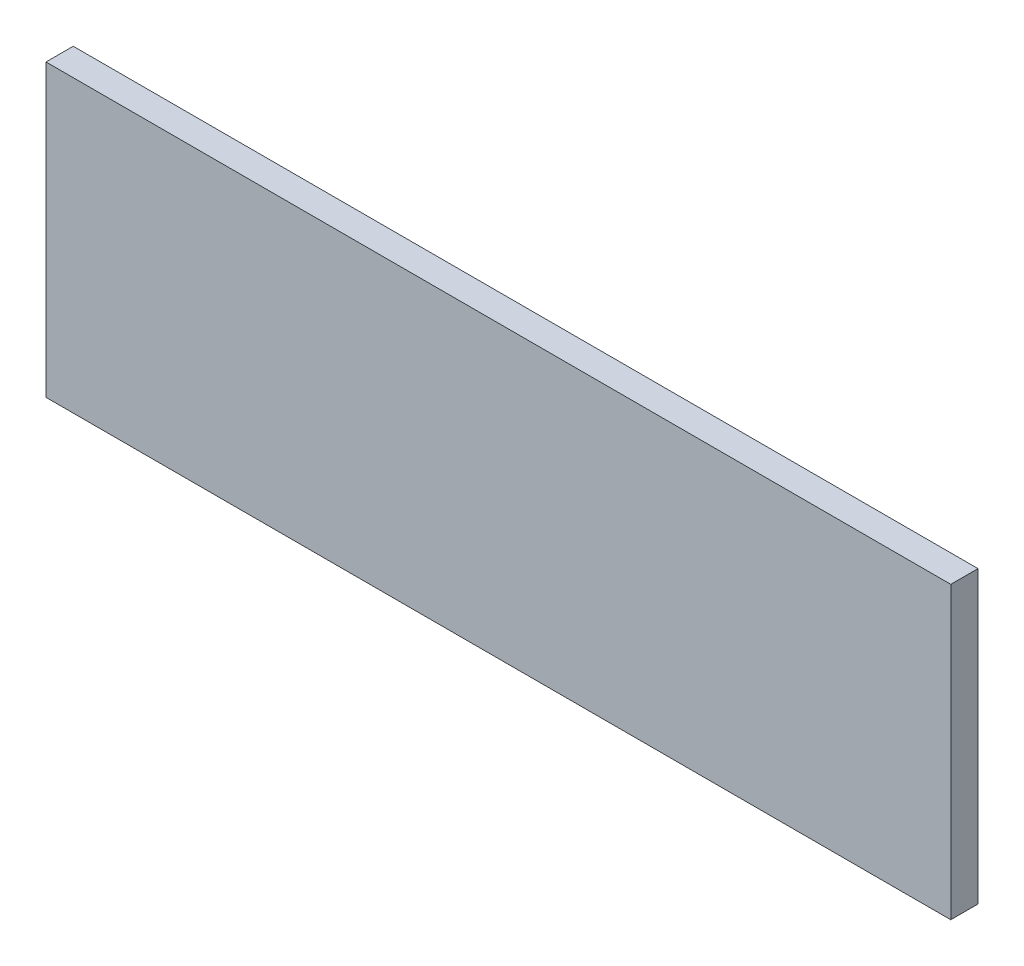
ISO-10303-21;
HEADER;
FILE_DESCRIPTION(('STEP AP214'),'2;1');
FILE_NAME('part.step','',(''),(''),'','','');
FILE_SCHEMA(('AUTOMOTIVE_DESIGN { 1 0 10303 214 1 1 1 1 }'));
ENDSEC;
DATA;
#1=APPLICATION_CONTEXT('core data for automotive mechanical design processes');
#2=APPLICATION_PROTOCOL_DEFINITION('international standard','automotive_design',2000,#1);
#3=PRODUCT_CONTEXT('',#1,'mechanical');
#4=PRODUCT('Part','Part','',(#3));
#5=PRODUCT_RELATED_PRODUCT_CATEGORY('part','',(#4));
#6=PRODUCT_DEFINITION_FORMATION('','',#4);
#7=PRODUCT_DEFINITION_CONTEXT('part definition',#1,'design');
#8=PRODUCT_DEFINITION('design','',#6,#7);
#9=PRODUCT_DEFINITION_SHAPE('','',#8);
#10=(LENGTH_UNIT() NAMED_UNIT(*) SI_UNIT(.MILLI.,.METRE.));
#11=(NAMED_UNIT(*) PLANE_ANGLE_UNIT() SI_UNIT($,.RADIAN.));
#12=(NAMED_UNIT(*) SI_UNIT($,.STERADIAN.) SOLID_ANGLE_UNIT());
#13=UNCERTAINTY_MEASURE_WITH_UNIT(LENGTH_MEASURE(1.E-05),#10,'distance_accuracy_value','');
#14=(GEOMETRIC_REPRESENTATION_CONTEXT(3) GLOBAL_UNCERTAINTY_ASSIGNED_CONTEXT((#13)) GLOBAL_UNIT_ASSIGNED_CONTEXT((#10,
#11,#12)) REPRESENTATION_CONTEXT('',''));
#15=CARTESIAN_POINT('',(0.,0.,0.));
#16=DIRECTION('',(0.,0.,1.));
#17=DIRECTION('',(1.,0.,0.));
#18=AXIS2_PLACEMENT_3D('',#15,#16,#17);
#19=CARTESIAN_POINT('',(-299.,-96.,18.));
#20=DIRECTION('',(1.,0.,0.));
#21=DIRECTION('',(0.,0.,-1.));
#22=AXIS2_PLACEMENT_3D('',#19,#20,#21);
#23=PLANE('',#22);
#24=DIRECTION('',(0.,-1.,0.));
#25=VECTOR('',#24,1.);
#26=CARTESIAN_POINT('',(-299.,-96.,0.));
#27=LINE('',#26,#25);
#28=CARTESIAN_POINT('',(-299.,96.,0.));
#29=VERTEX_POINT('',#28);
#30=CARTESIAN_POINT('',(-299.,-96.,0.));
#31=VERTEX_POINT('',#30);
#32=EDGE_CURVE('E96',#29,#31,#27,.T.);
#33=ORIENTED_EDGE('',*,*,#32,.T.);
#34=DIRECTION('',(0.,0.,-1.));
#35=VECTOR('',#34,1.);
#36=CARTESIAN_POINT('',(-299.,-96.,18.));
#37=LINE('',#36,#35);
#38=CARTESIAN_POINT('',(-299.,-96.,18.));
#39=VERTEX_POINT('',#38);
#40=EDGE_CURVE('E11',#39,#31,#37,.T.);
#41=ORIENTED_EDGE('',*,*,#40,.F.);
#42=DIRECTION('',(0.,-1.,0.));
#43=VECTOR('',#42,1.);
#44=CARTESIAN_POINT('',(-299.,-96.,18.));
#45=LINE('',#44,#43);
#46=CARTESIAN_POINT('',(-299.,96.,18.));
#47=VERTEX_POINT('',#46);
#48=EDGE_CURVE('E84',#47,#39,#45,.T.);
#49=ORIENTED_EDGE('',*,*,#48,.F.);
#50=DIRECTION('',(0.,0.,-1.));
#51=VECTOR('',#50,1.);
#52=CARTESIAN_POINT('',(-299.,96.,18.));
#53=LINE('',#52,#51);
#54=EDGE_CURVE('E92',#47,#29,#53,.T.);
#55=ORIENTED_EDGE('',*,*,#54,.T.);
#56=EDGE_LOOP('',(#33,#41,#49,#55));
#57=FACE_BOUND('',#56,.T.);
#58=ADVANCED_FACE('F33',(#57),#23,.F.);
#59=CARTESIAN_POINT('',(299.,-96.,18.));
#60=DIRECTION('',(0.,1.,0.));
#61=DIRECTION('',(-1.,0.,0.));
#62=AXIS2_PLACEMENT_3D('',#59,#60,#61);
#63=PLANE('',#62);
#64=DIRECTION('',(1.,0.,0.));
#65=VECTOR('',#64,1.);
#66=CARTESIAN_POINT('',(299.,-96.,0.));
#67=LINE('',#66,#65);
#68=CARTESIAN_POINT('',(299.,-96.,0.));
#69=VERTEX_POINT('',#68);
#70=EDGE_CURVE('E88',#31,#69,#67,.T.);
#71=ORIENTED_EDGE('',*,*,#70,.T.);
#72=DIRECTION('',(0.,0.,-1.));
#73=VECTOR('',#72,1.);
#74=CARTESIAN_POINT('',(299.,-96.,18.));
#75=LINE('',#74,#73);
#76=CARTESIAN_POINT('',(299.,-96.,18.));
#77=VERTEX_POINT('',#76);
#78=EDGE_CURVE('E41',#77,#69,#75,.T.);
#79=ORIENTED_EDGE('',*,*,#78,.F.);
#80=DIRECTION('',(1.,0.,0.));
#81=VECTOR('',#80,1.);
#82=CARTESIAN_POINT('',(299.,-96.,18.));
#83=LINE('',#82,#81);
#84=EDGE_CURVE('E79',#39,#77,#83,.T.);
#85=ORIENTED_EDGE('',*,*,#84,.F.);
#86=ORIENTED_EDGE('',*,*,#40,.T.);
#87=EDGE_LOOP('',(#71,#79,#85,#86));
#88=FACE_BOUND('',#87,.T.);
#89=ADVANCED_FACE('F87',(#88),#63,.F.);
#90=CARTESIAN_POINT('',(299.,-96.,18.));
#91=DIRECTION('',(-1.,0.,0.));
#92=DIRECTION('',(0.,0.,1.));
#93=AXIS2_PLACEMENT_3D('',#90,#91,#92);
#94=PLANE('',#93);
#95=DIRECTION('',(0.,1.,0.));
#96=VECTOR('',#95,1.);
#97=CARTESIAN_POINT('',(299.,-96.,0.));
#98=LINE('',#97,#96);
#99=CARTESIAN_POINT('',(299.,96.,0.));
#100=VERTEX_POINT('',#99);
#101=EDGE_CURVE('E66',#69,#100,#98,.T.);
#102=ORIENTED_EDGE('',*,*,#101,.T.);
#103=DIRECTION('',(0.,0.,-1.));
#104=VECTOR('',#103,1.);
#105=CARTESIAN_POINT('',(299.,96.,18.));
#106=LINE('',#105,#104);
#107=CARTESIAN_POINT('',(299.,96.,18.));
#108=VERTEX_POINT('',#107);
#109=EDGE_CURVE('E89',#108,#100,#106,.T.);
#110=ORIENTED_EDGE('',*,*,#109,.F.);
#111=DIRECTION('',(0.,1.,0.));
#112=VECTOR('',#111,1.);
#113=CARTESIAN_POINT('',(299.,-96.,18.));
#114=LINE('',#113,#112);
#115=EDGE_CURVE('E82',#77,#108,#114,.T.);
#116=ORIENTED_EDGE('',*,*,#115,.F.);
#117=ORIENTED_EDGE('',*,*,#78,.T.);
#118=EDGE_LOOP('',(#102,#110,#116,#117));
#119=FACE_BOUND('',#118,.T.);
#120=ADVANCED_FACE('F90',(#119),#94,.F.);
#121=CARTESIAN_POINT('',(299.,96.,18.));
#122=DIRECTION('',(0.,-1.,0.));
#123=DIRECTION('',(1.,0.,0.));
#124=AXIS2_PLACEMENT_3D('',#121,#122,#123);
#125=PLANE('',#124);
#126=DIRECTION('',(-1.,0.,0.));
#127=VECTOR('',#126,1.);
#128=CARTESIAN_POINT('',(299.,96.,0.));
#129=LINE('',#128,#127);
#130=EDGE_CURVE('E72',#100,#29,#129,.T.);
#131=ORIENTED_EDGE('',*,*,#130,.T.);
#132=ORIENTED_EDGE('',*,*,#54,.F.);
#133=DIRECTION('',(-1.,0.,0.));
#134=VECTOR('',#133,1.);
#135=CARTESIAN_POINT('',(299.,96.,18.));
#136=LINE('',#135,#134);
#137=EDGE_CURVE('E49',#108,#47,#136,.T.);
#138=ORIENTED_EDGE('',*,*,#137,.F.);
#139=ORIENTED_EDGE('',*,*,#109,.T.);
#140=EDGE_LOOP('',(#131,#132,#138,#139));
#141=FACE_BOUND('',#140,.T.);
#142=ADVANCED_FACE('F103',(#141),#125,.F.);
#143=CARTESIAN_POINT('',(0.,0.,18.));
#144=DIRECTION('',(0.,0.,1.));
#145=DIRECTION('',(1.,0.,0.));
#146=AXIS2_PLACEMENT_3D('',#143,#144,#145);
#147=PLANE('',#146);
#148=ORIENTED_EDGE('',*,*,#48,.T.);
#149=ORIENTED_EDGE('',*,*,#84,.T.);
#150=ORIENTED_EDGE('',*,*,#115,.T.);
#151=ORIENTED_EDGE('',*,*,#137,.T.);
#152=EDGE_LOOP('',(#148,#149,#150,#151));
#153=FACE_BOUND('',#152,.T.);
#154=ADVANCED_FACE('F80',(#153),#147,.T.);
#155=CARTESIAN_POINT('',(0.,0.,0.));
#156=DIRECTION('',(0.,0.,1.));
#157=DIRECTION('',(1.,0.,0.));
#158=AXIS2_PLACEMENT_3D('',#155,#156,#157);
#159=PLANE('',#158);
#160=ORIENTED_EDGE('',*,*,#32,.F.);
#161=ORIENTED_EDGE('',*,*,#130,.F.);
#162=ORIENTED_EDGE('',*,*,#101,.F.);
#163=ORIENTED_EDGE('',*,*,#70,.F.);
#164=EDGE_LOOP('',(#160,#161,#162,#163));
#165=FACE_BOUND('',#164,.T.);
#166=ADVANCED_FACE('F106',(#165),#159,.F.);
#167=CLOSED_SHELL('',(#58,#89,#120,#142,#154,#166));
#168=MANIFOLD_SOLID_BREP('B2',#167);
#169=ADVANCED_BREP_SHAPE_REPRESENTATION('',(#18,#168),#14);
#170=SHAPE_DEFINITION_REPRESENTATION(#9,#169);
ENDSEC;
END-ISO-10303-21;
